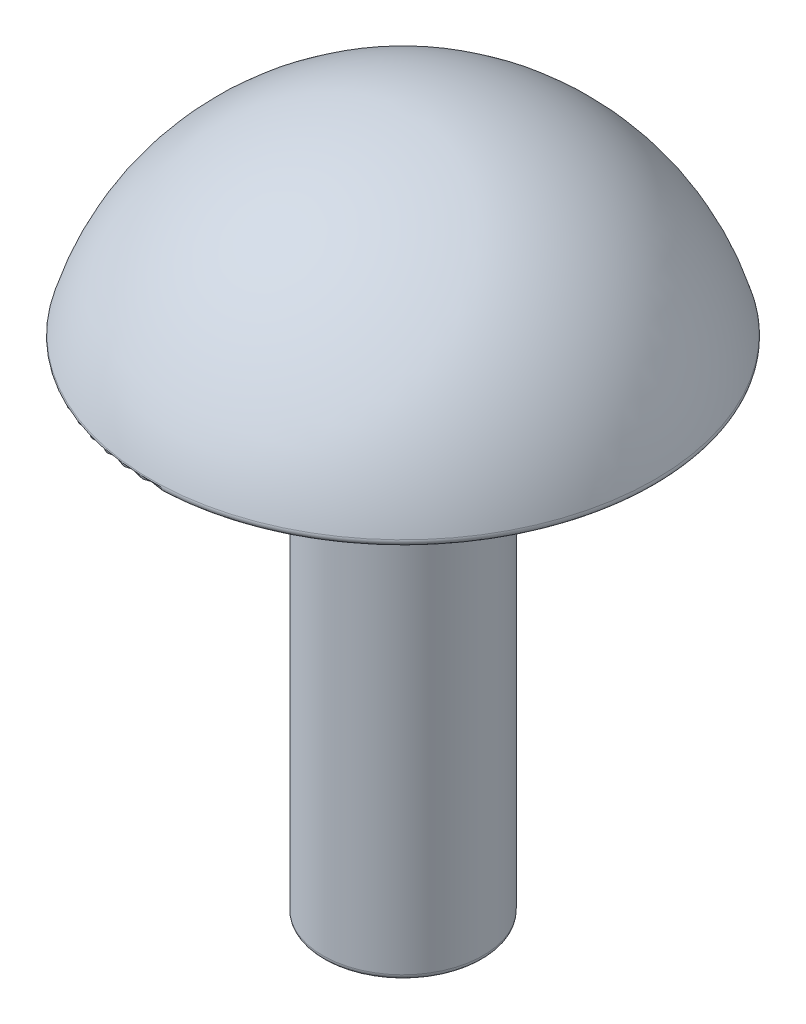
ISO-10303-21;
HEADER;
FILE_DESCRIPTION(('STEP AP214'),'2;1');
FILE_NAME('part.step','',(''),(''),'','','');
FILE_SCHEMA(('AUTOMOTIVE_DESIGN { 1 0 10303 214 1 1 1 1 }'));
ENDSEC;
DATA;
#1=APPLICATION_CONTEXT('core data for automotive mechanical design processes');
#2=APPLICATION_PROTOCOL_DEFINITION('international standard','automotive_design',2000,#1);
#3=PRODUCT_CONTEXT('',#1,'mechanical');
#4=PRODUCT('Part','Part','',(#3));
#5=PRODUCT_RELATED_PRODUCT_CATEGORY('part','',(#4));
#6=PRODUCT_DEFINITION_FORMATION('','',#4);
#7=PRODUCT_DEFINITION_CONTEXT('part definition',#1,'design');
#8=PRODUCT_DEFINITION('design','',#6,#7);
#9=PRODUCT_DEFINITION_SHAPE('','',#8);
#10=(LENGTH_UNIT() NAMED_UNIT(*) SI_UNIT(.MILLI.,.METRE.));
#11=(NAMED_UNIT(*) PLANE_ANGLE_UNIT() SI_UNIT($,.RADIAN.));
#12=(NAMED_UNIT(*) SI_UNIT($,.STERADIAN.) SOLID_ANGLE_UNIT());
#13=UNCERTAINTY_MEASURE_WITH_UNIT(LENGTH_MEASURE(1.E-05),#10,'distance_accuracy_value','');
#14=(GEOMETRIC_REPRESENTATION_CONTEXT(3) GLOBAL_UNCERTAINTY_ASSIGNED_CONTEXT((#13)) GLOBAL_UNIT_ASSIGNED_CONTEXT((#10,
#11,#12)) REPRESENTATION_CONTEXT('',''));
#15=CARTESIAN_POINT('',(0.,0.,0.));
#16=DIRECTION('',(0.,0.,1.));
#17=DIRECTION('',(1.,0.,0.));
#18=AXIS2_PLACEMENT_3D('',#15,#16,#17);
#19=CARTESIAN_POINT('',(0.,-1.33838863800788,0.));
#20=DIRECTION('',(0.,1.,0.));
#21=DIRECTION('',(1.,0.,0.));
#22=AXIS2_PLACEMENT_3D('',#19,#20,#21);
#23=SPHERICAL_SURFACE('',#22,4.89898648648649);
#24=CARTESIAN_POINT('',(0.,-0.0123342176952751,0.));
#25=DIRECTION('',(0.,-1.,0.));
#26=DIRECTION('',(1.,0.,0.));
#27=AXIS2_PLACEMENT_3D('',#24,#25,#26);
#28=CIRCLE('',#27,4.71610520123826);
#29=CARTESIAN_POINT('',(4.71610520123826,-0.0123342176952751,0.));
#30=VERTEX_POINT('',#29);
#31=EDGE_CURVE('E10',#30,#30,#28,.F.);
#32=ORIENTED_EDGE('',*,*,#31,.T.);
#33=EDGE_LOOP('',(#32));
#34=FACE_BOUND('',#33,.T.);
#35=ADVANCED_FACE('F32',(#34),#23,.T.);
#36=CARTESIAN_POINT('',(1.5,-0.139402151521393,0.));
#37=DIRECTION('',(0.,1.,0.));
#38=DIRECTION('',(-1.,0.,0.));
#39=AXIS2_PLACEMENT_3D('',#36,#37,#38);
#40=PLANE('',#39);
#41=CARTESIAN_POINT('',(0.,-0.139402151521393,0.));
#42=DIRECTION('',(0.,1.,0.));
#43=DIRECTION('',(-1.,0.,0.));
#44=AXIS2_PLACEMENT_3D('',#41,#42,#43);
#45=CIRCLE('',#44,1.6);
#46=CARTESIAN_POINT('',(-1.6,-0.139402151521393,0.));
#47=VERTEX_POINT('',#46);
#48=EDGE_CURVE('E39',#47,#47,#45,.T.);
#49=ORIENTED_EDGE('',*,*,#48,.T.);
#50=EDGE_LOOP('',(#49));
#51=FACE_BOUND('',#50,.T.);
#52=CARTESIAN_POINT('',(0.,-0.139402151521393,0.));
#53=DIRECTION('',(0.,1.,0.));
#54=DIRECTION('',(-1.,0.,0.));
#55=AXIS2_PLACEMENT_3D('',#52,#53,#54);
#56=CIRCLE('',#55,4.61983824450655);
#57=CARTESIAN_POINT('',(-4.61983824450655,-0.139402151521393,0.));
#58=VERTEX_POINT('',#57);
#59=EDGE_CURVE('E43',#58,#58,#56,.F.);
#60=ORIENTED_EDGE('',*,*,#59,.T.);
#61=EDGE_LOOP('',(#60));
#62=FACE_BOUND('',#61,.T.);
#63=ADVANCED_FACE('F74',(#51,#62),#40,.F.);
#64=CARTESIAN_POINT('',(0.,3.56059784847861,0.));
#65=DIRECTION('',(0.,1.,0.));
#66=DIRECTION('',(-1.,0.,0.));
#67=AXIS2_PLACEMENT_3D('',#64,#65,#66);
#68=CYLINDRICAL_SURFACE('',#67,1.5);
#69=CARTESIAN_POINT('',(0.,-9.33940215152139,0.));
#70=DIRECTION('',(0.,1.,0.));
#71=DIRECTION('',(-1.,0.,0.));
#72=AXIS2_PLACEMENT_3D('',#69,#70,#71);
#73=CIRCLE('',#72,1.5);
#74=CARTESIAN_POINT('',(-1.5,-9.33940215152139,0.));
#75=VERTEX_POINT('',#74);
#76=EDGE_CURVE('E52',#75,#75,#73,.T.);
#77=ORIENTED_EDGE('',*,*,#76,.T.);
#78=EDGE_LOOP('',(#77));
#79=FACE_BOUND('',#78,.T.);
#80=CARTESIAN_POINT('',(0.,-0.239402151521393,0.));
#81=DIRECTION('',(0.,1.,0.));
#82=DIRECTION('',(-1.,0.,0.));
#83=AXIS2_PLACEMENT_3D('',#80,#81,#82);
#84=CIRCLE('',#83,1.5);
#85=CARTESIAN_POINT('',(-1.5,-0.239402151521393,0.));
#86=VERTEX_POINT('',#85);
#87=EDGE_CURVE('E55',#86,#86,#84,.F.);
#88=ORIENTED_EDGE('',*,*,#87,.T.);
#89=EDGE_LOOP('',(#88));
#90=FACE_BOUND('',#89,.T.);
#91=ADVANCED_FACE('F59',(#79,#90),#68,.T.);
#92=CARTESIAN_POINT('',(0.,-9.43940215152139,0.));
#93=DIRECTION('',(0.,1.,0.));
#94=DIRECTION('',(-1.,0.,0.));
#95=AXIS2_PLACEMENT_3D('',#92,#93,#94);
#96=PLANE('',#95);
#97=CARTESIAN_POINT('',(0.,-9.43940215152139,0.));
#98=DIRECTION('',(0.,1.,0.));
#99=DIRECTION('',(-1.,0.,0.));
#100=AXIS2_PLACEMENT_3D('',#97,#98,#99);
#101=CIRCLE('',#100,1.4);
#102=CARTESIAN_POINT('',(-1.4,-9.43940215152139,0.));
#103=VERTEX_POINT('',#102);
#104=EDGE_CURVE('E47',#103,#103,#101,.F.);
#105=ORIENTED_EDGE('',*,*,#104,.T.);
#106=EDGE_LOOP('',(#105));
#107=FACE_BOUND('',#106,.T.);
#108=ADVANCED_FACE('F70',(#107),#96,.F.);
#109=CARTESIAN_POINT('',(0.,-9.33940215152139,0.));
#110=DIRECTION('',(0.,1.,0.));
#111=DIRECTION('',(-1.,0.,0.));
#112=AXIS2_PLACEMENT_3D('',#109,#110,#111);
#113=TOROIDAL_SURFACE('',#112,1.4,0.1);
#114=ORIENTED_EDGE('',*,*,#104,.F.);
#115=EDGE_LOOP('',(#114));
#116=FACE_BOUND('',#115,.T.);
#117=ORIENTED_EDGE('',*,*,#76,.F.);
#118=EDGE_LOOP('',(#117));
#119=FACE_BOUND('',#118,.T.);
#120=ADVANCED_FACE('F64',(#116,#119),#113,.T.);
#121=CARTESIAN_POINT('',(0.,-0.239402151521393,0.));
#122=DIRECTION('',(0.,1.,0.));
#123=DIRECTION('',(-1.,0.,0.));
#124=AXIS2_PLACEMENT_3D('',#121,#122,#123);
#125=TOROIDAL_SURFACE('',#124,1.6,0.1);
#126=ORIENTED_EDGE('',*,*,#87,.F.);
#127=EDGE_LOOP('',(#126));
#128=FACE_BOUND('',#127,.T.);
#129=ORIENTED_EDGE('',*,*,#48,.F.);
#130=EDGE_LOOP('',(#129));
#131=FACE_BOUND('',#130,.T.);
#132=ADVANCED_FACE('F61',(#128,#131),#125,.F.);
#133=CARTESIAN_POINT('',(0.,-0.0394021515213929,0.));
#134=DIRECTION('',(0.,1.,0.));
#135=DIRECTION('',(-1.,0.,0.));
#136=AXIS2_PLACEMENT_3D('',#133,#134,#135);
#137=TOROIDAL_SURFACE('',#136,4.61983824450655,0.1);
#138=ORIENTED_EDGE('',*,*,#59,.F.);
#139=EDGE_LOOP('',(#138));
#140=FACE_BOUND('',#139,.T.);
#141=ORIENTED_EDGE('',*,*,#31,.F.);
#142=EDGE_LOOP('',(#141));
#143=FACE_BOUND('',#142,.T.);
#144=ADVANCED_FACE('F34',(#140,#143),#137,.T.);
#145=CLOSED_SHELL('',(#35,#63,#91,#108,#120,#132,#144));
#146=MANIFOLD_SOLID_BREP('B2',#145);
#147=ADVANCED_BREP_SHAPE_REPRESENTATION('',(#18,#146),#14);
#148=SHAPE_DEFINITION_REPRESENTATION(#9,#147);
ENDSEC;
END-ISO-10303-21;
